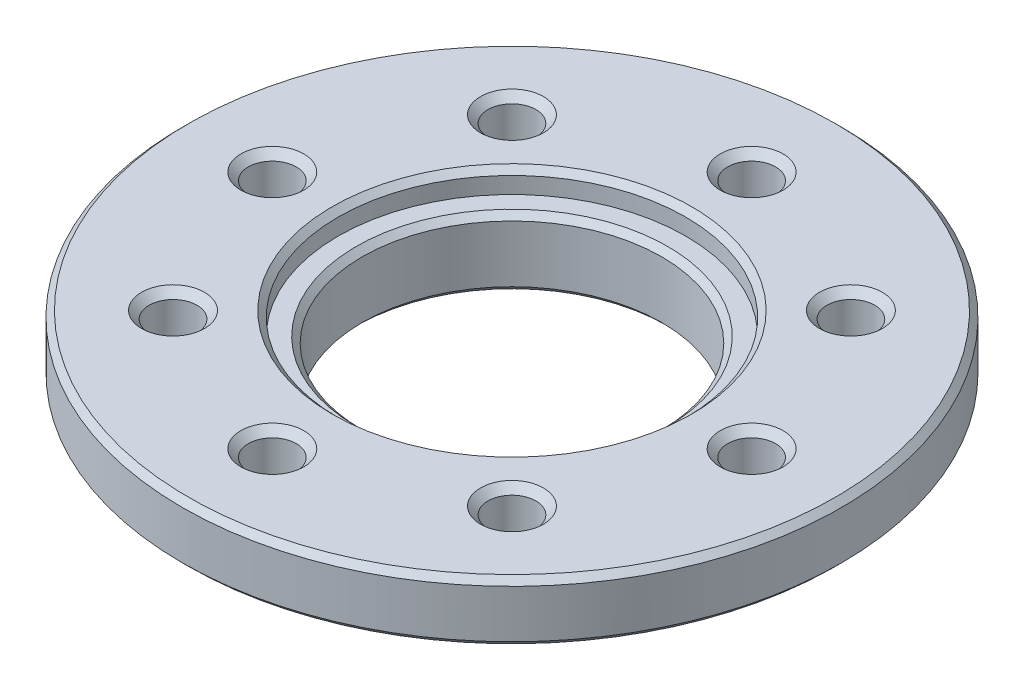
ISO-10303-21;
HEADER;
FILE_DESCRIPTION(('STEP AP214'),'2;1');
FILE_NAME('part.step','',(''),(''),'','','');
FILE_SCHEMA(('AUTOMOTIVE_DESIGN { 1 0 10303 214 1 1 1 1 }'));
ENDSEC;
DATA;
#1=APPLICATION_CONTEXT('core data for automotive mechanical design processes');
#2=APPLICATION_PROTOCOL_DEFINITION('international standard','automotive_design',2000,#1);
#3=PRODUCT_CONTEXT('',#1,'mechanical');
#4=PRODUCT('Part','Part','',(#3));
#5=PRODUCT_RELATED_PRODUCT_CATEGORY('part','',(#4));
#6=PRODUCT_DEFINITION_FORMATION('','',#4);
#7=PRODUCT_DEFINITION_CONTEXT('part definition',#1,'design');
#8=PRODUCT_DEFINITION('design','',#6,#7);
#9=PRODUCT_DEFINITION_SHAPE('','',#8);
#10=(LENGTH_UNIT() NAMED_UNIT(*) SI_UNIT(.MILLI.,.METRE.));
#11=(NAMED_UNIT(*) PLANE_ANGLE_UNIT() SI_UNIT($,.RADIAN.));
#12=(NAMED_UNIT(*) SI_UNIT($,.STERADIAN.) SOLID_ANGLE_UNIT());
#13=UNCERTAINTY_MEASURE_WITH_UNIT(LENGTH_MEASURE(1.E-05),#10,'distance_accuracy_value','');
#14=(GEOMETRIC_REPRESENTATION_CONTEXT(3) GLOBAL_UNCERTAINTY_ASSIGNED_CONTEXT((#13)) GLOBAL_UNIT_ASSIGNED_CONTEXT((#10,
#11,#12)) REPRESENTATION_CONTEXT('',''));
#15=CARTESIAN_POINT('',(0.,0.,0.));
#16=DIRECTION('',(0.,0.,1.));
#17=DIRECTION('',(1.,0.,0.));
#18=AXIS2_PLACEMENT_3D('',#15,#16,#17);
#19=CARTESIAN_POINT('',(0.,-0.750000000152795,0.));
#20=DIRECTION('',(0.,1.,0.));
#21=DIRECTION('',(0.,0.,1.));
#22=AXIS2_PLACEMENT_3D('',#19,#20,#21);
#23=CONICAL_SURFACE('',#22,5.19999999983156,0.785398163397448);
#24=CARTESIAN_POINT('',(0.,-0.750000000039108,0.));
#25=DIRECTION('',(0.,1.,0.));
#26=DIRECTION('',(0.,0.,1.));
#27=AXIS2_PLACEMENT_3D('',#24,#25,#26);
#28=CIRCLE('',#27,5.19999999994525);
#29=CARTESIAN_POINT('',(0.,-0.750000000039108,5.19999999994525));
#30=VERTEX_POINT('',#29);
#31=EDGE_CURVE('E17',#30,#30,#28,.T.);
#32=ORIENTED_EDGE('',*,*,#31,.T.);
#33=EDGE_LOOP('',(#32));
#34=FACE_BOUND('',#33,.T.);
#35=CARTESIAN_POINT('',(0.,-0.95,0.));
#36=DIRECTION('',(0.,-1.,0.));
#37=DIRECTION('',(0.,0.,-1.));
#38=AXIS2_PLACEMENT_3D('',#35,#36,#37);
#39=CIRCLE('',#38,5.);
#40=CARTESIAN_POINT('',(0.,-0.95,-5.));
#41=VERTEX_POINT('',#40);
#42=EDGE_CURVE('E29',#41,#41,#39,.T.);
#43=ORIENTED_EDGE('',*,*,#42,.T.);
#44=EDGE_LOOP('',(#43));
#45=FACE_BOUND('',#44,.T.);
#46=ADVANCED_FACE('F14',(#34,#45),#23,.F.);
#47=CARTESIAN_POINT('',(0.,-0.75,0.));
#48=DIRECTION('',(0.,-1.,0.));
#49=DIRECTION('',(0.,0.,-1.));
#50=AXIS2_PLACEMENT_3D('',#47,#48,#49);
#51=PLANE('',#50);
#52=ORIENTED_EDGE('',*,*,#31,.F.);
#53=EDGE_LOOP('',(#52));
#54=FACE_BOUND('',#53,.T.);
#55=CARTESIAN_POINT('',(0.,-0.75,0.));
#56=DIRECTION('',(0.,-1.,0.));
#57=DIRECTION('',(0.,0.,-1.));
#58=AXIS2_PLACEMENT_3D('',#55,#56,#57);
#59=CIRCLE('',#58,5.8);
#60=CARTESIAN_POINT('',(0.,-0.75,-5.8));
#61=VERTEX_POINT('',#60);
#62=EDGE_CURVE('E94',#61,#61,#59,.F.);
#63=ORIENTED_EDGE('',*,*,#62,.T.);
#64=EDGE_LOOP('',(#63));
#65=FACE_BOUND('',#64,.T.);
#66=ADVANCED_FACE('F107',(#54,#65),#51,.F.);
#67=CARTESIAN_POINT('',(0.,0.1525,0.));
#68=DIRECTION('',(0.,-1.,0.));
#69=DIRECTION('',(0.,0.,-1.));
#70=AXIS2_PLACEMENT_3D('',#67,#68,#69);
#71=CYLINDRICAL_SURFACE('',#70,5.);
#72=CARTESIAN_POINT('',(0.,-2.84999999996671,0.));
#73=DIRECTION('',(0.,-1.,0.));
#74=DIRECTION('',(-1.,0.,0.));
#75=AXIS2_PLACEMENT_3D('',#72,#73,#74);
#76=CIRCLE('',#75,4.99999999993861);
#77=CARTESIAN_POINT('',(-4.99999999993861,-2.84999999996671,0.));
#78=VERTEX_POINT('',#77);
#79=EDGE_CURVE('E96',#78,#78,#76,.T.);
#80=ORIENTED_EDGE('',*,*,#79,.T.);
#81=EDGE_LOOP('',(#80));
#82=FACE_BOUND('',#81,.T.);
#83=ORIENTED_EDGE('',*,*,#42,.F.);
#84=EDGE_LOOP('',(#83));
#85=FACE_BOUND('',#84,.T.);
#86=ADVANCED_FACE('F109',(#82,#85),#71,.F.);
#87=CARTESIAN_POINT('',(0.,0.1525,0.));
#88=DIRECTION('',(0.,-1.,0.));
#89=DIRECTION('',(0.,0.,-1.));
#90=AXIS2_PLACEMENT_3D('',#87,#88,#89);
#91=CYLINDRICAL_SURFACE('',#90,5.8);
#92=ORIENTED_EDGE('',*,*,#62,.F.);
#93=EDGE_LOOP('',(#92));
#94=FACE_BOUND('',#93,.T.);
#95=CARTESIAN_POINT('',(0.,-0.200000000006639,0.));
#96=DIRECTION('',(0.,1.,0.));
#97=DIRECTION('',(1.,0.,0.));
#98=AXIS2_PLACEMENT_3D('',#95,#96,#97);
#99=CIRCLE('',#98,5.80000000002201);
#100=CARTESIAN_POINT('',(5.80000000002201,-0.200000000006639,0.));
#101=VERTEX_POINT('',#100);
#102=EDGE_CURVE('E93',#101,#101,#99,.T.);
#103=ORIENTED_EDGE('',*,*,#102,.T.);
#104=EDGE_LOOP('',(#103));
#105=FACE_BOUND('',#104,.T.);
#106=ADVANCED_FACE('F115',(#94,#105),#91,.F.);
#107=CARTESIAN_POINT('',(0.,-3.04999999985966,0.));
#108=DIRECTION('',(0.,-1.,0.));
#109=DIRECTION('',(0.,0.,-1.));
#110=AXIS2_PLACEMENT_3D('',#107,#108,#109);
#111=CONICAL_SURFACE('',#110,5.19999999983156,0.785398163397448);
#112=ORIENTED_EDGE('',*,*,#79,.F.);
#113=EDGE_LOOP('',(#112));
#114=FACE_BOUND('',#113,.T.);
#115=CARTESIAN_POINT('',(0.,-3.04999999997335,0.));
#116=DIRECTION('',(0.,-1.,0.));
#117=DIRECTION('',(0.,0.,-1.));
#118=AXIS2_PLACEMENT_3D('',#115,#116,#117);
#119=CIRCLE('',#118,5.19999999994525);
#120=CARTESIAN_POINT('',(0.,-3.04999999997335,-5.19999999994525));
#121=VERTEX_POINT('',#120);
#122=EDGE_CURVE('E91',#121,#121,#119,.F.);
#123=ORIENTED_EDGE('',*,*,#122,.F.);
#124=EDGE_LOOP('',(#123));
#125=FACE_BOUND('',#124,.T.);
#126=ADVANCED_FACE('F220',(#114,#125),#111,.F.);
#127=CARTESIAN_POINT('',(0.,-5.6843418860808E-11,0.));
#128=DIRECTION('',(0.,1.,0.));
#129=DIRECTION('',(0.,0.,1.));
#130=AXIS2_PLACEMENT_3D('',#127,#128,#129);
#131=CONICAL_SURFACE('',#130,5.99999999997181,0.785398163397448);
#132=CARTESIAN_POINT('',(0.,-5.6843418860808E-11,0.));
#133=DIRECTION('',(0.,1.,0.));
#134=DIRECTION('',(0.,0.,1.));
#135=AXIS2_PLACEMENT_3D('',#132,#133,#134);
#136=CIRCLE('',#135,5.99999999997181);
#137=CARTESIAN_POINT('',(0.,-5.6843418860808E-11,5.99999999997181));
#138=VERTEX_POINT('',#137);
#139=EDGE_CURVE('E85',#138,#138,#136,.T.);
#140=ORIENTED_EDGE('',*,*,#139,.T.);
#141=EDGE_LOOP('',(#140));
#142=FACE_BOUND('',#141,.T.);
#143=ORIENTED_EDGE('',*,*,#102,.F.);
#144=EDGE_LOOP('',(#143));
#145=FACE_BOUND('',#144,.T.);
#146=ADVANCED_FACE('F216',(#142,#145),#131,.F.);
#147=CARTESIAN_POINT('',(0.,-0.200000000000015,0.));
#148=DIRECTION('',(0.,-1.,0.));
#149=DIRECTION('',(0.,0.,-1.));
#150=AXIS2_PLACEMENT_3D('',#147,#148,#149);
#151=CONICAL_SURFACE('',#150,11.,0.7853981633973);
#152=CARTESIAN_POINT('',(0.,-0.2,0.));
#153=DIRECTION('',(0.,-1.,0.));
#154=DIRECTION('',(0.,0.,-1.));
#155=AXIS2_PLACEMENT_3D('',#152,#153,#154);
#156=CIRCLE('',#155,11.);
#157=CARTESIAN_POINT('',(0.,-0.2,-11.));
#158=VERTEX_POINT('',#157);
#159=EDGE_CURVE('E84',#158,#158,#156,.T.);
#160=ORIENTED_EDGE('',*,*,#159,.F.);
#161=EDGE_LOOP('',(#160));
#162=FACE_BOUND('',#161,.T.);
#163=CARTESIAN_POINT('',(0.,0.,0.));
#164=DIRECTION('',(0.,-1.,0.));
#165=DIRECTION('',(0.,0.,-1.));
#166=AXIS2_PLACEMENT_3D('',#163,#164,#165);
#167=CIRCLE('',#166,10.8);
#168=CARTESIAN_POINT('',(0.,0.,-10.8));
#169=VERTEX_POINT('',#168);
#170=EDGE_CURVE('E88',#169,#169,#167,.T.);
#171=ORIENTED_EDGE('',*,*,#170,.T.);
#172=EDGE_LOOP('',(#171));
#173=FACE_BOUND('',#172,.T.);
#174=ADVANCED_FACE('F212',(#162,#173),#151,.T.);
#175=CARTESIAN_POINT('',(0.,-3.05,0.));
#176=DIRECTION('',(0.,-1.,0.));
#177=DIRECTION('',(0.,0.,-1.));
#178=AXIS2_PLACEMENT_3D('',#175,#176,#177);
#179=PLANE('',#178);
#180=ORIENTED_EDGE('',*,*,#122,.T.);
#181=EDGE_LOOP('',(#180));
#182=FACE_BOUND('',#181,.T.);
#183=CARTESIAN_POINT('',(0.,-3.0500000000302,0.));
#184=DIRECTION('',(0.,1.,0.));
#185=DIRECTION('',(0.,0.,1.));
#186=AXIS2_PLACEMENT_3D('',#183,#184,#185);
#187=CIRCLE('',#186,6.04999999995925);
#188=CARTESIAN_POINT('',(0.,-3.0500000000302,6.04999999995925));
#189=VERTEX_POINT('',#188);
#190=EDGE_CURVE('E81',#189,#189,#187,.T.);
#191=ORIENTED_EDGE('',*,*,#190,.F.);
#192=EDGE_LOOP('',(#191));
#193=FACE_BOUND('',#192,.T.);
#194=ADVANCED_FACE('F208',(#182,#193),#179,.T.);
#195=CARTESIAN_POINT('',(0.,0.,0.));
#196=DIRECTION('',(0.,-1.,0.));
#197=DIRECTION('',(0.,0.,-1.));
#198=AXIS2_PLACEMENT_3D('',#195,#196,#197);
#199=PLANE('',#198);
#200=CARTESIAN_POINT('',(-5.656854249492,0.,-5.656854249492));
#201=DIRECTION('',(0.,1.,0.));
#202=DIRECTION('',(0.,0.,1.));
#203=AXIS2_PLACEMENT_3D('',#200,#201,#202);
#204=CIRCLE('',#203,1.04999999997565);
#205=CARTESIAN_POINT('',(-5.656854249492,0.,-4.60685424951635));
#206=VERTEX_POINT('',#205);
#207=EDGE_CURVE('E56',#206,#206,#204,.F.);
#208=ORIENTED_EDGE('',*,*,#207,.T.);
#209=EDGE_LOOP('',(#208));
#210=FACE_BOUND('',#209,.T.);
#211=CARTESIAN_POINT('',(-8.,0.,0.));
#212=DIRECTION('',(0.,1.,0.));
#213=DIRECTION('',(0.,0.,1.));
#214=AXIS2_PLACEMENT_3D('',#211,#212,#213);
#215=CIRCLE('',#214,1.05000000003929);
#216=CARTESIAN_POINT('',(-8.,0.,1.05000000003929));
#217=VERTEX_POINT('',#216);
#218=EDGE_CURVE('E60',#217,#217,#215,.F.);
#219=ORIENTED_EDGE('',*,*,#218,.T.);
#220=EDGE_LOOP('',(#219));
#221=FACE_BOUND('',#220,.T.);
#222=CARTESIAN_POINT('',(-5.656854249492,0.,5.656854249492));
#223=DIRECTION('',(0.,1.,0.));
#224=DIRECTION('',(0.,0.,1.));
#225=AXIS2_PLACEMENT_3D('',#222,#223,#224);
#226=CIRCLE('',#225,1.04999999997565);
#227=CARTESIAN_POINT('',(-5.656854249492,0.,6.70685424946765));
#228=VERTEX_POINT('',#227);
#229=EDGE_CURVE('E63',#228,#228,#226,.F.);
#230=ORIENTED_EDGE('',*,*,#229,.T.);
#231=EDGE_LOOP('',(#230));
#232=FACE_BOUND('',#231,.T.);
#233=CARTESIAN_POINT('',(0.,-5.6843418860808E-11,8.));
#234=DIRECTION('',(0.,1.,0.));
#235=DIRECTION('',(0.,0.,1.));
#236=AXIS2_PLACEMENT_3D('',#233,#234,#235);
#237=CIRCLE('',#236,1.04999999990696);
#238=CARTESIAN_POINT('',(0.,-5.6843418860808E-11,9.04999999990696));
#239=VERTEX_POINT('',#238);
#240=EDGE_CURVE('E66',#239,#239,#237,.F.);
#241=ORIENTED_EDGE('',*,*,#240,.T.);
#242=EDGE_LOOP('',(#241));
#243=FACE_BOUND('',#242,.T.);
#244=CARTESIAN_POINT('',(5.656854249492,0.,5.656854249492));
#245=DIRECTION('',(0.,1.,0.));
#246=DIRECTION('',(0.,0.,1.));
#247=AXIS2_PLACEMENT_3D('',#244,#245,#246);
#248=CIRCLE('',#247,1.04999999995195);
#249=CARTESIAN_POINT('',(5.656854249492,0.,6.70685424944395));
#250=VERTEX_POINT('',#249);
#251=EDGE_CURVE('E69',#250,#250,#248,.F.);
#252=ORIENTED_EDGE('',*,*,#251,.T.);
#253=EDGE_LOOP('',(#252));
#254=FACE_BOUND('',#253,.T.);
#255=CARTESIAN_POINT('',(8.,0.,0.));
#256=DIRECTION('',(0.,1.,0.));
#257=DIRECTION('',(0.,0.,1.));
#258=AXIS2_PLACEMENT_3D('',#255,#256,#257);
#259=CIRCLE('',#258,1.050000000002);
#260=CARTESIAN_POINT('',(8.,0.,1.050000000002));
#261=VERTEX_POINT('',#260);
#262=EDGE_CURVE('E72',#261,#261,#259,.F.);
#263=ORIENTED_EDGE('',*,*,#262,.T.);
#264=EDGE_LOOP('',(#263));
#265=FACE_BOUND('',#264,.T.);
#266=CARTESIAN_POINT('',(5.656854249492,0.,-5.656854249492));
#267=DIRECTION('',(0.,1.,0.));
#268=DIRECTION('',(0.,0.,1.));
#269=AXIS2_PLACEMENT_3D('',#266,#267,#268);
#270=CIRCLE('',#269,1.04999999995195);
#271=CARTESIAN_POINT('',(5.656854249492,0.,-4.60685424954005));
#272=VERTEX_POINT('',#271);
#273=EDGE_CURVE('E75',#272,#272,#270,.F.);
#274=ORIENTED_EDGE('',*,*,#273,.T.);
#275=EDGE_LOOP('',(#274));
#276=FACE_BOUND('',#275,.T.);
#277=CARTESIAN_POINT('',(0.,-5.6843418860808E-11,-8.));
#278=DIRECTION('',(0.,1.,0.));
#279=DIRECTION('',(0.,0.,1.));
#280=AXIS2_PLACEMENT_3D('',#277,#278,#279);
#281=CIRCLE('',#280,1.04999999990696);
#282=CARTESIAN_POINT('',(0.,-5.6843418860808E-11,-6.95000000009304));
#283=VERTEX_POINT('',#282);
#284=EDGE_CURVE('E78',#283,#283,#281,.F.);
#285=ORIENTED_EDGE('',*,*,#284,.T.);
#286=EDGE_LOOP('',(#285));
#287=FACE_BOUND('',#286,.T.);
#288=ORIENTED_EDGE('',*,*,#139,.F.);
#289=EDGE_LOOP('',(#288));
#290=FACE_BOUND('',#289,.T.);
#291=ORIENTED_EDGE('',*,*,#170,.F.);
#292=EDGE_LOOP('',(#291));
#293=FACE_BOUND('',#292,.T.);
#294=ADVANCED_FACE('F204',(#210,#221,#232,#243,#254,#265,#276,#287,#290,#293),#199,.F.);
#295=CARTESIAN_POINT('',(0.,0.1525,0.));
#296=DIRECTION('',(0.,-1.,0.));
#297=DIRECTION('',(0.,0.,-1.));
#298=AXIS2_PLACEMENT_3D('',#295,#296,#297);
#299=CYLINDRICAL_SURFACE('',#298,11.);
#300=CARTESIAN_POINT('',(0.,-1.79999999999999,0.));
#301=DIRECTION('',(0.,1.,0.));
#302=DIRECTION('',(1.,0.,0.));
#303=AXIS2_PLACEMENT_3D('',#300,#301,#302);
#304=CIRCLE('',#303,11.);
#305=CARTESIAN_POINT('',(11.,-1.79999999999998,0.));
#306=VERTEX_POINT('',#305);
#307=EDGE_CURVE('E59',#306,#306,#304,.F.);
#308=ORIENTED_EDGE('',*,*,#307,.F.);
#309=EDGE_LOOP('',(#308));
#310=FACE_BOUND('',#309,.T.);
#311=ORIENTED_EDGE('',*,*,#159,.T.);
#312=EDGE_LOOP('',(#311));
#313=FACE_BOUND('',#312,.T.);
#314=ADVANCED_FACE('F200',(#310,#313),#299,.T.);
#315=CARTESIAN_POINT('',(0.,-2.8500000000804,0.));
#316=DIRECTION('',(0.,1.,0.));
#317=DIRECTION('',(0.,0.,1.));
#318=AXIS2_PLACEMENT_3D('',#315,#316,#317);
#319=CONICAL_SURFACE('',#318,6.24999999990905,0.785398163397448);
#320=ORIENTED_EDGE('',*,*,#190,.T.);
#321=EDGE_LOOP('',(#320));
#322=FACE_BOUND('',#321,.T.);
#323=CARTESIAN_POINT('',(0.,-2.85,0.));
#324=DIRECTION('',(0.,-1.,0.));
#325=DIRECTION('',(0.,0.,-1.));
#326=AXIS2_PLACEMENT_3D('',#323,#324,#325);
#327=CIRCLE('',#326,6.25);
#328=CARTESIAN_POINT('',(0.,-2.85,-6.25));
#329=VERTEX_POINT('',#328);
#330=EDGE_CURVE('E239',#329,#329,#327,.F.);
#331=ORIENTED_EDGE('',*,*,#330,.F.);
#332=EDGE_LOOP('',(#331));
#333=FACE_BOUND('',#332,.T.);
#334=ADVANCED_FACE('F196',(#322,#333),#319,.T.);
#335=CARTESIAN_POINT('',(0.,-1.70530256582424E-10,-8.));
#336=DIRECTION('',(0.,1.,0.));
#337=DIRECTION('',(0.,0.,1.));
#338=AXIS2_PLACEMENT_3D('',#335,#336,#337);
#339=CONICAL_SURFACE('',#338,1.04999999979327,0.785398163397448);
#340=CARTESIAN_POINT('',(0.,-0.25,-8.));
#341=DIRECTION('',(0.,1.,0.));
#342=DIRECTION('',(0.,0.,1.));
#343=AXIS2_PLACEMENT_3D('',#340,#341,#342);
#344=CIRCLE('',#343,0.8);
#345=CARTESIAN_POINT('',(0.,-0.25,-7.2));
#346=VERTEX_POINT('',#345);
#347=EDGE_CURVE('E242',#346,#346,#344,.F.);
#348=ORIENTED_EDGE('',*,*,#347,.T.);
#349=EDGE_LOOP('',(#348));
#350=FACE_BOUND('',#349,.T.);
#351=ORIENTED_EDGE('',*,*,#284,.F.);
#352=EDGE_LOOP('',(#351));
#353=FACE_BOUND('',#352,.T.);
#354=ADVANCED_FACE('F192',(#350,#353),#339,.F.);
#355=CARTESIAN_POINT('',(5.656854249492,-5.6843418860808E-11,-5.656854249492));
#356=DIRECTION('',(0.,1.,0.));
#357=DIRECTION('',(0.,0.,1.));
#358=AXIS2_PLACEMENT_3D('',#355,#356,#357);
#359=CONICAL_SURFACE('',#358,1.04999999989511,0.785398163283761);
#360=CARTESIAN_POINT('',(5.656854249492,-0.25,-5.656854249492));
#361=DIRECTION('',(0.,1.,0.));
#362=DIRECTION('',(0.,0.,1.));
#363=AXIS2_PLACEMENT_3D('',#360,#361,#362);
#364=CIRCLE('',#363,0.8);
#365=CARTESIAN_POINT('',(5.656854249492,-0.25,-4.856854249492));
#366=VERTEX_POINT('',#365);
#367=EDGE_CURVE('E245',#366,#366,#364,.F.);
#368=ORIENTED_EDGE('',*,*,#367,.T.);
#369=EDGE_LOOP('',(#368));
#370=FACE_BOUND('',#369,.T.);
#371=ORIENTED_EDGE('',*,*,#273,.F.);
#372=EDGE_LOOP('',(#371));
#373=FACE_BOUND('',#372,.T.);
#374=ADVANCED_FACE('F188',(#370,#373),#359,.F.);
#375=CARTESIAN_POINT('',(8.,-1.13686837721616E-10,0.));
#376=DIRECTION('',(0.,1.,0.));
#377=DIRECTION('',(0.,0.,1.));
#378=AXIS2_PLACEMENT_3D('',#375,#376,#377);
#379=CONICAL_SURFACE('',#378,1.04999999988831,0.785398163397448);
#380=CARTESIAN_POINT('',(8.,-0.25,0.));
#381=DIRECTION('',(0.,1.,0.));
#382=DIRECTION('',(0.,0.,1.));
#383=AXIS2_PLACEMENT_3D('',#380,#381,#382);
#384=CIRCLE('',#383,0.8);
#385=CARTESIAN_POINT('',(8.,-0.25,0.8));
#386=VERTEX_POINT('',#385);
#387=EDGE_CURVE('E248',#386,#386,#384,.F.);
#388=ORIENTED_EDGE('',*,*,#387,.T.);
#389=EDGE_LOOP('',(#388));
#390=FACE_BOUND('',#389,.T.);
#391=ORIENTED_EDGE('',*,*,#262,.F.);
#392=EDGE_LOOP('',(#391));
#393=FACE_BOUND('',#392,.T.);
#394=ADVANCED_FACE('F184',(#390,#393),#379,.F.);
#395=CARTESIAN_POINT('',(5.656854249492,-5.6843418860808E-11,5.656854249492));
#396=DIRECTION('',(0.,1.,0.));
#397=DIRECTION('',(0.,0.,1.));
#398=AXIS2_PLACEMENT_3D('',#395,#396,#397);
#399=CONICAL_SURFACE('',#398,1.04999999989511,0.785398163283761);
#400=CARTESIAN_POINT('',(5.656854249492,-0.25,5.656854249492));
#401=DIRECTION('',(0.,1.,0.));
#402=DIRECTION('',(0.,0.,1.));
#403=AXIS2_PLACEMENT_3D('',#400,#401,#402);
#404=CIRCLE('',#403,0.8);
#405=CARTESIAN_POINT('',(5.656854249492,-0.25,6.456854249492));
#406=VERTEX_POINT('',#405);
#407=EDGE_CURVE('E251',#406,#406,#404,.F.);
#408=ORIENTED_EDGE('',*,*,#407,.T.);
#409=EDGE_LOOP('',(#408));
#410=FACE_BOUND('',#409,.T.);
#411=ORIENTED_EDGE('',*,*,#251,.F.);
#412=EDGE_LOOP('',(#411));
#413=FACE_BOUND('',#412,.T.);
#414=ADVANCED_FACE('F180',(#410,#413),#399,.F.);
#415=CARTESIAN_POINT('',(0.,-1.70530256582424E-10,8.));
#416=DIRECTION('',(0.,1.,0.));
#417=DIRECTION('',(0.,0.,1.));
#418=AXIS2_PLACEMENT_3D('',#415,#416,#417);
#419=CONICAL_SURFACE('',#418,1.04999999979327,0.785398163397448);
#420=CARTESIAN_POINT('',(0.,-0.25,8.));
#421=DIRECTION('',(0.,1.,0.));
#422=DIRECTION('',(0.,0.,1.));
#423=AXIS2_PLACEMENT_3D('',#420,#421,#422);
#424=CIRCLE('',#423,0.8);
#425=CARTESIAN_POINT('',(0.,-0.25,8.8));
#426=VERTEX_POINT('',#425);
#427=EDGE_CURVE('E254',#426,#426,#424,.F.);
#428=ORIENTED_EDGE('',*,*,#427,.T.);
#429=EDGE_LOOP('',(#428));
#430=FACE_BOUND('',#429,.T.);
#431=ORIENTED_EDGE('',*,*,#240,.F.);
#432=EDGE_LOOP('',(#431));
#433=FACE_BOUND('',#432,.T.);
#434=ADVANCED_FACE('F176',(#430,#433),#419,.F.);
#435=CARTESIAN_POINT('',(-5.656854249492,-5.6843418860808E-11,5.656854249492));
#436=DIRECTION('',(0.,1.,0.));
#437=DIRECTION('',(0.,0.,1.));
#438=AXIS2_PLACEMENT_3D('',#435,#436,#437);
#439=CONICAL_SURFACE('',#438,1.04999999991881,0.785398163397448);
#440=CARTESIAN_POINT('',(-5.656854249492,-0.25,5.656854249492));
#441=DIRECTION('',(0.,1.,0.));
#442=DIRECTION('',(0.,0.,1.));
#443=AXIS2_PLACEMENT_3D('',#440,#441,#442);
#444=CIRCLE('',#443,0.8);
#445=CARTESIAN_POINT('',(-5.656854249492,-0.25,6.456854249492));
#446=VERTEX_POINT('',#445);
#447=EDGE_CURVE('E257',#446,#446,#444,.F.);
#448=ORIENTED_EDGE('',*,*,#447,.T.);
#449=EDGE_LOOP('',(#448));
#450=FACE_BOUND('',#449,.T.);
#451=ORIENTED_EDGE('',*,*,#229,.F.);
#452=EDGE_LOOP('',(#451));
#453=FACE_BOUND('',#452,.T.);
#454=ADVANCED_FACE('F172',(#450,#453),#439,.F.);
#455=CARTESIAN_POINT('',(-8.,-5.6843418860808E-11,0.));
#456=DIRECTION('',(0.,1.,0.));
#457=DIRECTION('',(0.,0.,1.));
#458=AXIS2_PLACEMENT_3D('',#455,#456,#457);
#459=CONICAL_SURFACE('',#458,1.04999999998245,0.785398163397448);
#460=CARTESIAN_POINT('',(-8.,-0.25,0.));
#461=DIRECTION('',(0.,1.,0.));
#462=DIRECTION('',(0.,0.,1.));
#463=AXIS2_PLACEMENT_3D('',#460,#461,#462);
#464=CIRCLE('',#463,0.8);
#465=CARTESIAN_POINT('',(-8.,-0.25,0.8));
#466=VERTEX_POINT('',#465);
#467=EDGE_CURVE('E260',#466,#466,#464,.F.);
#468=ORIENTED_EDGE('',*,*,#467,.T.);
#469=EDGE_LOOP('',(#468));
#470=FACE_BOUND('',#469,.T.);
#471=ORIENTED_EDGE('',*,*,#218,.F.);
#472=EDGE_LOOP('',(#471));
#473=FACE_BOUND('',#472,.T.);
#474=ADVANCED_FACE('F168',(#470,#473),#459,.F.);
#475=CARTESIAN_POINT('',(-5.656854249492,-5.6843418860808E-11,-5.656854249492));
#476=DIRECTION('',(0.,1.,0.));
#477=DIRECTION('',(0.,0.,1.));
#478=AXIS2_PLACEMENT_3D('',#475,#476,#477);
#479=CONICAL_SURFACE('',#478,1.04999999991881,0.785398163397448);
#480=CARTESIAN_POINT('',(-5.656854249492,-0.25,-5.656854249492));
#481=DIRECTION('',(0.,1.,0.));
#482=DIRECTION('',(0.,0.,1.));
#483=AXIS2_PLACEMENT_3D('',#480,#481,#482);
#484=CIRCLE('',#483,0.8);
#485=CARTESIAN_POINT('',(-5.656854249492,-0.25,-4.856854249492));
#486=VERTEX_POINT('',#485);
#487=EDGE_CURVE('E55',#486,#486,#484,.F.);
#488=ORIENTED_EDGE('',*,*,#487,.T.);
#489=EDGE_LOOP('',(#488));
#490=FACE_BOUND('',#489,.T.);
#491=ORIENTED_EDGE('',*,*,#207,.F.);
#492=EDGE_LOOP('',(#491));
#493=FACE_BOUND('',#492,.T.);
#494=ADVANCED_FACE('F164',(#490,#493),#479,.F.);
#495=CARTESIAN_POINT('',(0.,-1.79999999999999,0.));
#496=DIRECTION('',(0.,1.,0.));
#497=DIRECTION('',(0.,0.,1.));
#498=AXIS2_PLACEMENT_3D('',#495,#496,#497);
#499=CONICAL_SURFACE('',#498,11.,0.785398163397302);
#500=CARTESIAN_POINT('',(0.,-2.00000000000001,0.));
#501=DIRECTION('',(0.,1.,0.));
#502=DIRECTION('',(0.,0.,1.));
#503=AXIS2_PLACEMENT_3D('',#500,#501,#502);
#504=CIRCLE('',#503,10.8);
#505=CARTESIAN_POINT('',(0.,-2.00000000000001,10.8));
#506=VERTEX_POINT('',#505);
#507=EDGE_CURVE('E52',#506,#506,#504,.F.);
#508=ORIENTED_EDGE('',*,*,#507,.F.);
#509=EDGE_LOOP('',(#508));
#510=FACE_BOUND('',#509,.T.);
#511=ORIENTED_EDGE('',*,*,#307,.T.);
#512=EDGE_LOOP('',(#511));
#513=FACE_BOUND('',#512,.T.);
#514=ADVANCED_FACE('F160',(#510,#513),#499,.T.);
#515=CARTESIAN_POINT('',(0.,0.1525,0.));
#516=DIRECTION('',(0.,-1.,0.));
#517=DIRECTION('',(0.,0.,-1.));
#518=AXIS2_PLACEMENT_3D('',#515,#516,#517);
#519=CYLINDRICAL_SURFACE('',#518,6.25);
#520=CARTESIAN_POINT('',(0.,-2.,0.));
#521=DIRECTION('',(0.,-1.,0.));
#522=DIRECTION('',(0.,0.,-1.));
#523=AXIS2_PLACEMENT_3D('',#520,#521,#522);
#524=CIRCLE('',#523,6.25);
#525=CARTESIAN_POINT('',(0.,-2.,-6.25));
#526=VERTEX_POINT('',#525);
#527=EDGE_CURVE('E49',#526,#526,#524,.F.);
#528=ORIENTED_EDGE('',*,*,#527,.F.);
#529=EDGE_LOOP('',(#528));
#530=FACE_BOUND('',#529,.T.);
#531=ORIENTED_EDGE('',*,*,#330,.T.);
#532=EDGE_LOOP('',(#531));
#533=FACE_BOUND('',#532,.T.);
#534=ADVANCED_FACE('F156',(#530,#533),#519,.T.);
#535=CARTESIAN_POINT('',(0.,-3.52275,-8.));
#536=DIRECTION('',(0.,1.,0.));
#537=DIRECTION('',(0.,0.,1.));
#538=AXIS2_PLACEMENT_3D('',#535,#536,#537);
#539=CYLINDRICAL_SURFACE('',#538,0.8);
#540=ORIENTED_EDGE('',*,*,#347,.F.);
#541=EDGE_LOOP('',(#540));
#542=FACE_BOUND('',#541,.T.);
#543=CARTESIAN_POINT('',(0.,-2.,-8.));
#544=DIRECTION('',(0.,1.,0.));
#545=DIRECTION('',(0.,0.,1.));
#546=AXIS2_PLACEMENT_3D('',#543,#544,#545);
#547=CIRCLE('',#546,0.8);
#548=CARTESIAN_POINT('',(0.,-2.,-7.2));
#549=VERTEX_POINT('',#548);
#550=EDGE_CURVE('E46',#549,#549,#547,.T.);
#551=ORIENTED_EDGE('',*,*,#550,.F.);
#552=EDGE_LOOP('',(#551));
#553=FACE_BOUND('',#552,.T.);
#554=ADVANCED_FACE('F152',(#542,#553),#539,.F.);
#555=CARTESIAN_POINT('',(5.656854249492,-3.52275,-5.656854249492));
#556=DIRECTION('',(0.,1.,0.));
#557=DIRECTION('',(0.,0.,1.));
#558=AXIS2_PLACEMENT_3D('',#555,#556,#557);
#559=CYLINDRICAL_SURFACE('',#558,0.8);
#560=ORIENTED_EDGE('',*,*,#367,.F.);
#561=EDGE_LOOP('',(#560));
#562=FACE_BOUND('',#561,.T.);
#563=CARTESIAN_POINT('',(5.656854249492,-2.,-5.656854249492));
#564=DIRECTION('',(0.,1.,0.));
#565=DIRECTION('',(0.,0.,1.));
#566=AXIS2_PLACEMENT_3D('',#563,#564,#565);
#567=CIRCLE('',#566,0.8);
#568=CARTESIAN_POINT('',(5.656854249492,-2.,-4.856854249492));
#569=VERTEX_POINT('',#568);
#570=EDGE_CURVE('E43',#569,#569,#567,.T.);
#571=ORIENTED_EDGE('',*,*,#570,.F.);
#572=EDGE_LOOP('',(#571));
#573=FACE_BOUND('',#572,.T.);
#574=ADVANCED_FACE('F148',(#562,#573),#559,.F.);
#575=CARTESIAN_POINT('',(8.,-3.52275,0.));
#576=DIRECTION('',(0.,1.,0.));
#577=DIRECTION('',(0.,0.,1.));
#578=AXIS2_PLACEMENT_3D('',#575,#576,#577);
#579=CYLINDRICAL_SURFACE('',#578,0.8);
#580=ORIENTED_EDGE('',*,*,#387,.F.);
#581=EDGE_LOOP('',(#580));
#582=FACE_BOUND('',#581,.T.);
#583=CARTESIAN_POINT('',(8.,-2.,0.));
#584=DIRECTION('',(0.,1.,0.));
#585=DIRECTION('',(0.,0.,1.));
#586=AXIS2_PLACEMENT_3D('',#583,#584,#585);
#587=CIRCLE('',#586,0.8);
#588=CARTESIAN_POINT('',(8.,-2.,0.8));
#589=VERTEX_POINT('',#588);
#590=EDGE_CURVE('E40',#589,#589,#587,.T.);
#591=ORIENTED_EDGE('',*,*,#590,.F.);
#592=EDGE_LOOP('',(#591));
#593=FACE_BOUND('',#592,.T.);
#594=ADVANCED_FACE('F144',(#582,#593),#579,.F.);
#595=CARTESIAN_POINT('',(5.656854249492,-3.52275,5.656854249492));
#596=DIRECTION('',(0.,1.,0.));
#597=DIRECTION('',(0.,0.,1.));
#598=AXIS2_PLACEMENT_3D('',#595,#596,#597);
#599=CYLINDRICAL_SURFACE('',#598,0.8);
#600=ORIENTED_EDGE('',*,*,#407,.F.);
#601=EDGE_LOOP('',(#600));
#602=FACE_BOUND('',#601,.T.);
#603=CARTESIAN_POINT('',(5.656854249492,-2.,5.656854249492));
#604=DIRECTION('',(0.,1.,0.));
#605=DIRECTION('',(0.,0.,1.));
#606=AXIS2_PLACEMENT_3D('',#603,#604,#605);
#607=CIRCLE('',#606,0.8);
#608=CARTESIAN_POINT('',(5.656854249492,-2.,6.456854249492));
#609=VERTEX_POINT('',#608);
#610=EDGE_CURVE('E37',#609,#609,#607,.T.);
#611=ORIENTED_EDGE('',*,*,#610,.F.);
#612=EDGE_LOOP('',(#611));
#613=FACE_BOUND('',#612,.T.);
#614=ADVANCED_FACE('F140',(#602,#613),#599,.F.);
#615=CARTESIAN_POINT('',(0.,-3.52275,8.));
#616=DIRECTION('',(0.,1.,0.));
#617=DIRECTION('',(0.,0.,1.));
#618=AXIS2_PLACEMENT_3D('',#615,#616,#617);
#619=CYLINDRICAL_SURFACE('',#618,0.8);
#620=ORIENTED_EDGE('',*,*,#427,.F.);
#621=EDGE_LOOP('',(#620));
#622=FACE_BOUND('',#621,.T.);
#623=CARTESIAN_POINT('',(0.,-2.,8.));
#624=DIRECTION('',(0.,1.,0.));
#625=DIRECTION('',(0.,0.,1.));
#626=AXIS2_PLACEMENT_3D('',#623,#624,#625);
#627=CIRCLE('',#626,0.8);
#628=CARTESIAN_POINT('',(0.,-2.,8.8));
#629=VERTEX_POINT('',#628);
#630=EDGE_CURVE('E34',#629,#629,#627,.T.);
#631=ORIENTED_EDGE('',*,*,#630,.F.);
#632=EDGE_LOOP('',(#631));
#633=FACE_BOUND('',#632,.T.);
#634=ADVANCED_FACE('F136',(#622,#633),#619,.F.);
#635=CARTESIAN_POINT('',(-5.656854249492,-3.52275,5.656854249492));
#636=DIRECTION('',(0.,1.,0.));
#637=DIRECTION('',(0.,0.,1.));
#638=AXIS2_PLACEMENT_3D('',#635,#636,#637);
#639=CYLINDRICAL_SURFACE('',#638,0.8);
#640=ORIENTED_EDGE('',*,*,#447,.F.);
#641=EDGE_LOOP('',(#640));
#642=FACE_BOUND('',#641,.T.);
#643=CARTESIAN_POINT('',(-5.656854249492,-2.,5.656854249492));
#644=DIRECTION('',(0.,1.,0.));
#645=DIRECTION('',(0.,0.,1.));
#646=AXIS2_PLACEMENT_3D('',#643,#644,#645);
#647=CIRCLE('',#646,0.8);
#648=CARTESIAN_POINT('',(-5.656854249492,-2.,6.456854249492));
#649=VERTEX_POINT('',#648);
#650=EDGE_CURVE('E26',#649,#649,#647,.T.);
#651=ORIENTED_EDGE('',*,*,#650,.F.);
#652=EDGE_LOOP('',(#651));
#653=FACE_BOUND('',#652,.T.);
#654=ADVANCED_FACE('F132',(#642,#653),#639,.F.);
#655=CARTESIAN_POINT('',(-8.,-3.52275,0.));
#656=DIRECTION('',(0.,1.,0.));
#657=DIRECTION('',(0.,0.,1.));
#658=AXIS2_PLACEMENT_3D('',#655,#656,#657);
#659=CYLINDRICAL_SURFACE('',#658,0.8);
#660=ORIENTED_EDGE('',*,*,#467,.F.);
#661=EDGE_LOOP('',(#660));
#662=FACE_BOUND('',#661,.T.);
#663=CARTESIAN_POINT('',(-8.,-2.,0.));
#664=DIRECTION('',(0.,1.,0.));
#665=DIRECTION('',(0.,0.,1.));
#666=AXIS2_PLACEMENT_3D('',#663,#664,#665);
#667=CIRCLE('',#666,0.8);
#668=CARTESIAN_POINT('',(-8.,-2.,0.8));
#669=VERTEX_POINT('',#668);
#670=EDGE_CURVE('E21',#669,#669,#667,.T.);
#671=ORIENTED_EDGE('',*,*,#670,.F.);
#672=EDGE_LOOP('',(#671));
#673=FACE_BOUND('',#672,.T.);
#674=ADVANCED_FACE('F125',(#662,#673),#659,.F.);
#675=CARTESIAN_POINT('',(-5.656854249492,-3.52275,-5.656854249492));
#676=DIRECTION('',(0.,1.,0.));
#677=DIRECTION('',(0.,0.,1.));
#678=AXIS2_PLACEMENT_3D('',#675,#676,#677);
#679=CYLINDRICAL_SURFACE('',#678,0.8);
#680=ORIENTED_EDGE('',*,*,#487,.F.);
#681=EDGE_LOOP('',(#680));
#682=FACE_BOUND('',#681,.T.);
#683=CARTESIAN_POINT('',(-5.656854249492,-2.,-5.656854249492));
#684=DIRECTION('',(0.,1.,0.));
#685=DIRECTION('',(0.,0.,1.));
#686=AXIS2_PLACEMENT_3D('',#683,#684,#685);
#687=CIRCLE('',#686,0.8);
#688=CARTESIAN_POINT('',(-5.656854249492,-2.,-4.856854249492));
#689=VERTEX_POINT('',#688);
#690=EDGE_CURVE('E10',#689,#689,#687,.T.);
#691=ORIENTED_EDGE('',*,*,#690,.F.);
#692=EDGE_LOOP('',(#691));
#693=FACE_BOUND('',#692,.T.);
#694=ADVANCED_FACE('F120',(#682,#693),#679,.F.);
#695=CARTESIAN_POINT('',(0.,-2.,0.));
#696=DIRECTION('',(0.,-1.,0.));
#697=DIRECTION('',(0.,0.,-1.));
#698=AXIS2_PLACEMENT_3D('',#695,#696,#697);
#699=PLANE('',#698);
#700=ORIENTED_EDGE('',*,*,#690,.T.);
#701=EDGE_LOOP('',(#700));
#702=FACE_BOUND('',#701,.T.);
#703=ORIENTED_EDGE('',*,*,#670,.T.);
#704=EDGE_LOOP('',(#703));
#705=FACE_BOUND('',#704,.T.);
#706=ORIENTED_EDGE('',*,*,#650,.T.);
#707=EDGE_LOOP('',(#706));
#708=FACE_BOUND('',#707,.T.);
#709=ORIENTED_EDGE('',*,*,#630,.T.);
#710=EDGE_LOOP('',(#709));
#711=FACE_BOUND('',#710,.T.);
#712=ORIENTED_EDGE('',*,*,#610,.T.);
#713=EDGE_LOOP('',(#712));
#714=FACE_BOUND('',#713,.T.);
#715=ORIENTED_EDGE('',*,*,#590,.T.);
#716=EDGE_LOOP('',(#715));
#717=FACE_BOUND('',#716,.T.);
#718=ORIENTED_EDGE('',*,*,#570,.T.);
#719=EDGE_LOOP('',(#718));
#720=FACE_BOUND('',#719,.T.);
#721=ORIENTED_EDGE('',*,*,#550,.T.);
#722=EDGE_LOOP('',(#721));
#723=FACE_BOUND('',#722,.T.);
#724=ORIENTED_EDGE('',*,*,#527,.T.);
#725=EDGE_LOOP('',(#724));
#726=FACE_BOUND('',#725,.T.);
#727=ORIENTED_EDGE('',*,*,#507,.T.);
#728=EDGE_LOOP('',(#727));
#729=FACE_BOUND('',#728,.T.);
#730=ADVANCED_FACE('F118',(#702,#705,#708,#711,#714,#717,#720,#723,#726,#729),#699,.T.);
#731=CLOSED_SHELL('',(#46,#66,#86,#106,#126,#146,#174,#194,#294,#314,#334,#354,#374,#394,#414,
#434,#454,#474,#494,#514,#534,#554,#574,#594,#614,#634,#654,#674,#694,#730));
#732=MANIFOLD_SOLID_BREP('B1',#731);
#733=ADVANCED_BREP_SHAPE_REPRESENTATION('',(#18,#732),#14);
#734=SHAPE_DEFINITION_REPRESENTATION(#9,#733);
ENDSEC;
END-ISO-10303-21;
